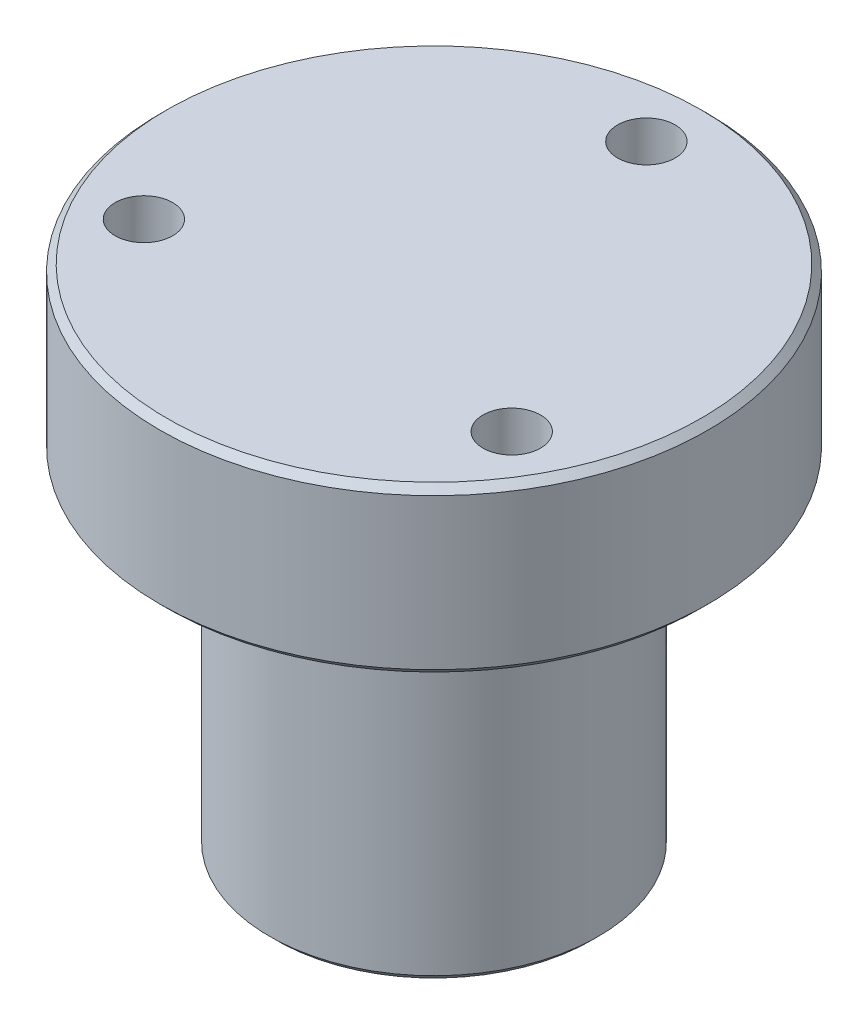
ISO-10303-21;
HEADER;
FILE_DESCRIPTION(('STEP AP214'),'2;1');
FILE_NAME('part.step','',(''),(''),'','','');
FILE_SCHEMA(('AUTOMOTIVE_DESIGN { 1 0 10303 214 1 1 1 1 }'));
ENDSEC;
DATA;
#1=APPLICATION_CONTEXT('core data for automotive mechanical design processes');
#2=APPLICATION_PROTOCOL_DEFINITION('international standard','automotive_design',2000,#1);
#3=PRODUCT_CONTEXT('',#1,'mechanical');
#4=PRODUCT('Part','Part','',(#3));
#5=PRODUCT_RELATED_PRODUCT_CATEGORY('part','',(#4));
#6=PRODUCT_DEFINITION_FORMATION('','',#4);
#7=PRODUCT_DEFINITION_CONTEXT('part definition',#1,'design');
#8=PRODUCT_DEFINITION('design','',#6,#7);
#9=PRODUCT_DEFINITION_SHAPE('','',#8);
#10=(LENGTH_UNIT() NAMED_UNIT(*) SI_UNIT(.MILLI.,.METRE.));
#11=(NAMED_UNIT(*) PLANE_ANGLE_UNIT() SI_UNIT($,.RADIAN.));
#12=(NAMED_UNIT(*) SI_UNIT($,.STERADIAN.) SOLID_ANGLE_UNIT());
#13=UNCERTAINTY_MEASURE_WITH_UNIT(LENGTH_MEASURE(1.E-05),#10,'distance_accuracy_value','');
#14=(GEOMETRIC_REPRESENTATION_CONTEXT(3) GLOBAL_UNCERTAINTY_ASSIGNED_CONTEXT((#13)) GLOBAL_UNIT_ASSIGNED_CONTEXT((#10,
#11,#12)) REPRESENTATION_CONTEXT('',''));
#15=CARTESIAN_POINT('',(0.,0.,0.));
#16=DIRECTION('',(0.,0.,1.));
#17=DIRECTION('',(1.,0.,0.));
#18=AXIS2_PLACEMENT_3D('',#15,#16,#17);
#19=CARTESIAN_POINT('',(11.5,0.,0.));
#20=DIRECTION('',(0.,-1.,0.));
#21=DIRECTION('',(0.,0.,-1.));
#22=AXIS2_PLACEMENT_3D('',#19,#20,#21);
#23=PLANE('',#22);
#24=CARTESIAN_POINT('',(0.,0.,0.));
#25=DIRECTION('',(0.,-1.,0.));
#26=DIRECTION('',(0.,0.,-1.));
#27=AXIS2_PLACEMENT_3D('',#24,#25,#26);
#28=CIRCLE('',#27,11.5);
#29=CARTESIAN_POINT('',(0.,0.,-11.5));
#30=VERTEX_POINT('',#29);
#31=EDGE_CURVE('E72',#30,#30,#28,.T.);
#32=ORIENTED_EDGE('',*,*,#31,.T.);
#33=EDGE_LOOP('',(#32));
#34=FACE_BOUND('',#33,.T.);
#35=ADVANCED_FACE('F43',(#34),#23,.T.);
#36=CARTESIAN_POINT('',(0.,37.,0.));
#37=DIRECTION('',(0.,1.,0.));
#38=DIRECTION('',(0.,0.,1.));
#39=AXIS2_PLACEMENT_3D('',#36,#37,#38);
#40=PLANE('',#39);
#41=CARTESIAN_POINT('',(0.,37.,-15.5));
#42=DIRECTION('',(0.,1.,0.));
#43=DIRECTION('',(0.,0.,1.));
#44=AXIS2_PLACEMENT_3D('',#41,#42,#43);
#45=CIRCLE('',#44,2.10058);
#46=CARTESIAN_POINT('',(0.,37.,-13.39942));
#47=VERTEX_POINT('',#46);
#48=EDGE_CURVE('E65',#47,#47,#45,.T.);
#49=ORIENTED_EDGE('',*,*,#48,.F.);
#50=EDGE_LOOP('',(#49));
#51=FACE_BOUND('',#50,.T.);
#52=CARTESIAN_POINT('',(13.4233937586595,37.,7.74999999999962));
#53=DIRECTION('',(0.,1.,0.));
#54=DIRECTION('',(0.,0.,1.));
#55=AXIS2_PLACEMENT_3D('',#52,#53,#54);
#56=CIRCLE('',#55,2.10058000000059);
#57=CARTESIAN_POINT('',(13.4233937586595,37.,9.85058000000021));
#58=VERTEX_POINT('',#57);
#59=EDGE_CURVE('E130',#58,#58,#56,.T.);
#60=ORIENTED_EDGE('',*,*,#59,.F.);
#61=EDGE_LOOP('',(#60));
#62=FACE_BOUND('',#61,.T.);
#63=CARTESIAN_POINT('',(-13.4233937586581,37.,7.75000000000038));
#64=DIRECTION('',(0.,1.,0.));
#65=DIRECTION('',(0.,0.,1.));
#66=AXIS2_PLACEMENT_3D('',#63,#64,#65);
#67=CIRCLE('',#66,2.10058000000087);
#68=CARTESIAN_POINT('',(-13.4233937586581,37.,9.85058000000125));
#69=VERTEX_POINT('',#68);
#70=EDGE_CURVE('E86',#69,#69,#67,.T.);
#71=ORIENTED_EDGE('',*,*,#70,.F.);
#72=EDGE_LOOP('',(#71));
#73=FACE_BOUND('',#72,.T.);
#74=CARTESIAN_POINT('',(0.,37.,0.));
#75=DIRECTION('',(0.,-1.,0.));
#76=DIRECTION('',(0.,0.,-1.));
#77=AXIS2_PLACEMENT_3D('',#74,#75,#76);
#78=CIRCLE('',#77,19.5);
#79=CARTESIAN_POINT('',(0.,37.,-19.5));
#80=VERTEX_POINT('',#79);
#81=EDGE_CURVE('E10',#80,#80,#78,.T.);
#82=ORIENTED_EDGE('',*,*,#81,.F.);
#83=EDGE_LOOP('',(#82));
#84=FACE_BOUND('',#83,.T.);
#85=ADVANCED_FACE('F113',(#51,#62,#73,#84),#40,.T.);
#86=CARTESIAN_POINT('',(0.,36.5,0.));
#87=DIRECTION('',(0.,-1.,0.));
#88=DIRECTION('',(0.,0.,-1.));
#89=AXIS2_PLACEMENT_3D('',#86,#87,#88);
#90=CONICAL_SURFACE('',#89,20.,0.785398163397448);
#91=ORIENTED_EDGE('',*,*,#81,.T.);
#92=EDGE_LOOP('',(#91));
#93=FACE_BOUND('',#92,.T.);
#94=CARTESIAN_POINT('',(0.,36.5,0.));
#95=DIRECTION('',(0.,-1.,0.));
#96=DIRECTION('',(0.,0.,-1.));
#97=AXIS2_PLACEMENT_3D('',#94,#95,#96);
#98=CIRCLE('',#97,20.);
#99=CARTESIAN_POINT('',(0.,36.5,-20.));
#100=VERTEX_POINT('',#99);
#101=EDGE_CURVE('E51',#100,#100,#98,.T.);
#102=ORIENTED_EDGE('',*,*,#101,.F.);
#103=EDGE_LOOP('',(#102));
#104=FACE_BOUND('',#103,.T.);
#105=ADVANCED_FACE('F104',(#93,#104),#90,.T.);
#106=CARTESIAN_POINT('',(0.,0.,0.));
#107=DIRECTION('',(0.,-1.,0.));
#108=DIRECTION('',(0.,0.,-1.));
#109=AXIS2_PLACEMENT_3D('',#106,#107,#108);
#110=CYLINDRICAL_SURFACE('',#109,20.);
#111=ORIENTED_EDGE('',*,*,#101,.T.);
#112=EDGE_LOOP('',(#111));
#113=FACE_BOUND('',#112,.T.);
#114=CARTESIAN_POINT('',(0.,25.5,0.));
#115=DIRECTION('',(0.,-1.,0.));
#116=DIRECTION('',(0.,0.,-1.));
#117=AXIS2_PLACEMENT_3D('',#114,#115,#116);
#118=CIRCLE('',#117,20.);
#119=CARTESIAN_POINT('',(0.,25.5,-20.));
#120=VERTEX_POINT('',#119);
#121=EDGE_CURVE('E57',#120,#120,#118,.T.);
#122=ORIENTED_EDGE('',*,*,#121,.F.);
#123=EDGE_LOOP('',(#122));
#124=FACE_BOUND('',#123,.T.);
#125=ADVANCED_FACE('F102',(#113,#124),#110,.T.);
#126=CARTESIAN_POINT('',(0.,25.,0.));
#127=DIRECTION('',(0.,1.,0.));
#128=DIRECTION('',(0.,0.,1.));
#129=AXIS2_PLACEMENT_3D('',#126,#127,#128);
#130=CONICAL_SURFACE('',#129,19.5,0.785398163397448);
#131=ORIENTED_EDGE('',*,*,#121,.T.);
#132=EDGE_LOOP('',(#131));
#133=FACE_BOUND('',#132,.T.);
#134=CARTESIAN_POINT('',(0.,25.,0.));
#135=DIRECTION('',(0.,-1.,0.));
#136=DIRECTION('',(0.,0.,-1.));
#137=AXIS2_PLACEMENT_3D('',#134,#135,#136);
#138=CIRCLE('',#137,19.5);
#139=CARTESIAN_POINT('',(0.,25.,-19.5));
#140=VERTEX_POINT('',#139);
#141=EDGE_CURVE('E92',#140,#140,#138,.T.);
#142=ORIENTED_EDGE('',*,*,#141,.F.);
#143=EDGE_LOOP('',(#142));
#144=FACE_BOUND('',#143,.T.);
#145=ADVANCED_FACE('F99',(#133,#144),#130,.T.);
#146=CARTESIAN_POINT('',(19.5,25.,0.));
#147=DIRECTION('',(0.,-1.,0.));
#148=DIRECTION('',(0.,0.,-1.));
#149=AXIS2_PLACEMENT_3D('',#146,#147,#148);
#150=PLANE('',#149);
#151=CARTESIAN_POINT('',(0.,25.,-15.5));
#152=DIRECTION('',(0.,-1.,0.));
#153=DIRECTION('',(0.,0.,-1.));
#154=AXIS2_PLACEMENT_3D('',#151,#152,#153);
#155=CIRCLE('',#154,2.10058);
#156=CARTESIAN_POINT('',(0.,25.,-17.60058));
#157=VERTEX_POINT('',#156);
#158=EDGE_CURVE('E46',#157,#157,#155,.T.);
#159=ORIENTED_EDGE('',*,*,#158,.F.);
#160=EDGE_LOOP('',(#159));
#161=FACE_BOUND('',#160,.T.);
#162=CARTESIAN_POINT('',(13.4233937586595,25.,7.74999999999962));
#163=DIRECTION('',(0.,-1.,0.));
#164=DIRECTION('',(0.,0.,-1.));
#165=AXIS2_PLACEMENT_3D('',#162,#163,#164);
#166=CIRCLE('',#165,2.10058000000059);
#167=CARTESIAN_POINT('',(13.4233937586595,25.,5.64941999999903));
#168=VERTEX_POINT('',#167);
#169=EDGE_CURVE('E64',#168,#168,#166,.T.);
#170=ORIENTED_EDGE('',*,*,#169,.F.);
#171=EDGE_LOOP('',(#170));
#172=FACE_BOUND('',#171,.T.);
#173=CARTESIAN_POINT('',(-13.4233937586581,25.,7.75000000000038));
#174=DIRECTION('',(0.,-1.,0.));
#175=DIRECTION('',(0.,0.,-1.));
#176=AXIS2_PLACEMENT_3D('',#173,#174,#175);
#177=CIRCLE('',#176,2.10058000000087);
#178=CARTESIAN_POINT('',(-13.4233937586581,25.,5.64941999999951));
#179=VERTEX_POINT('',#178);
#180=EDGE_CURVE('E61',#179,#179,#177,.T.);
#181=ORIENTED_EDGE('',*,*,#180,.F.);
#182=EDGE_LOOP('',(#181));
#183=FACE_BOUND('',#182,.T.);
#184=ORIENTED_EDGE('',*,*,#141,.T.);
#185=EDGE_LOOP('',(#184));
#186=FACE_BOUND('',#185,.T.);
#187=CARTESIAN_POINT('',(0.,25.,0.));
#188=DIRECTION('',(0.,-1.,0.));
#189=DIRECTION('',(0.,0.,-1.));
#190=AXIS2_PLACEMENT_3D('',#187,#188,#189);
#191=CIRCLE('',#190,12.);
#192=CARTESIAN_POINT('',(0.,25.,-12.));
#193=VERTEX_POINT('',#192);
#194=EDGE_CURVE('E83',#193,#193,#191,.T.);
#195=ORIENTED_EDGE('',*,*,#194,.F.);
#196=EDGE_LOOP('',(#195));
#197=FACE_BOUND('',#196,.T.);
#198=ADVANCED_FACE('F111',(#161,#172,#183,#186,#197),#150,.T.);
#199=CARTESIAN_POINT('',(0.,0.,0.));
#200=DIRECTION('',(0.,-1.,0.));
#201=DIRECTION('',(0.,0.,-1.));
#202=AXIS2_PLACEMENT_3D('',#199,#200,#201);
#203=CYLINDRICAL_SURFACE('',#202,12.);
#204=ORIENTED_EDGE('',*,*,#194,.T.);
#205=EDGE_LOOP('',(#204));
#206=FACE_BOUND('',#205,.T.);
#207=CARTESIAN_POINT('',(0.,0.5,0.));
#208=DIRECTION('',(0.,-1.,0.));
#209=DIRECTION('',(0.,0.,-1.));
#210=AXIS2_PLACEMENT_3D('',#207,#208,#209);
#211=CIRCLE('',#210,12.);
#212=CARTESIAN_POINT('',(0.,0.5,-12.));
#213=VERTEX_POINT('',#212);
#214=EDGE_CURVE('E77',#213,#213,#211,.T.);
#215=ORIENTED_EDGE('',*,*,#214,.F.);
#216=EDGE_LOOP('',(#215));
#217=FACE_BOUND('',#216,.T.);
#218=ADVANCED_FACE('F156',(#206,#217),#203,.T.);
#219=CARTESIAN_POINT('',(0.,0.,0.));
#220=DIRECTION('',(0.,1.,0.));
#221=DIRECTION('',(0.,0.,1.));
#222=AXIS2_PLACEMENT_3D('',#219,#220,#221);
#223=CONICAL_SURFACE('',#222,11.5,0.785398163397449);
#224=ORIENTED_EDGE('',*,*,#214,.T.);
#225=EDGE_LOOP('',(#224));
#226=FACE_BOUND('',#225,.T.);
#227=ORIENTED_EDGE('',*,*,#31,.F.);
#228=EDGE_LOOP('',(#227));
#229=FACE_BOUND('',#228,.T.);
#230=ADVANCED_FACE('F153',(#226,#229),#223,.T.);
#231=CARTESIAN_POINT('',(-13.4233937586581,0.,7.75000000000038));
#232=DIRECTION('',(0.,1.,0.));
#233=DIRECTION('',(0.,0.,1.));
#234=AXIS2_PLACEMENT_3D('',#231,#232,#233);
#235=CYLINDRICAL_SURFACE('',#234,2.10058000000087);
#236=ORIENTED_EDGE('',*,*,#180,.T.);
#237=EDGE_LOOP('',(#236));
#238=FACE_BOUND('',#237,.T.);
#239=ORIENTED_EDGE('',*,*,#70,.T.);
#240=EDGE_LOOP('',(#239));
#241=FACE_BOUND('',#240,.T.);
#242=ADVANCED_FACE('F148',(#238,#241),#235,.F.);
#243=CARTESIAN_POINT('',(13.4233937586595,0.,7.74999999999962));
#244=DIRECTION('',(0.,1.,0.));
#245=DIRECTION('',(0.,0.,1.));
#246=AXIS2_PLACEMENT_3D('',#243,#244,#245);
#247=CYLINDRICAL_SURFACE('',#246,2.10058000000059);
#248=ORIENTED_EDGE('',*,*,#169,.T.);
#249=EDGE_LOOP('',(#248));
#250=FACE_BOUND('',#249,.T.);
#251=ORIENTED_EDGE('',*,*,#59,.T.);
#252=EDGE_LOOP('',(#251));
#253=FACE_BOUND('',#252,.T.);
#254=ADVANCED_FACE('F143',(#250,#253),#247,.F.);
#255=CARTESIAN_POINT('',(0.,0.,-15.5));
#256=DIRECTION('',(0.,1.,0.));
#257=DIRECTION('',(0.,0.,1.));
#258=AXIS2_PLACEMENT_3D('',#255,#256,#257);
#259=CYLINDRICAL_SURFACE('',#258,2.10058);
#260=ORIENTED_EDGE('',*,*,#158,.T.);
#261=EDGE_LOOP('',(#260));
#262=FACE_BOUND('',#261,.T.);
#263=ORIENTED_EDGE('',*,*,#48,.T.);
#264=EDGE_LOOP('',(#263));
#265=FACE_BOUND('',#264,.T.);
#266=ADVANCED_FACE('F141',(#262,#265),#259,.F.);
#267=CLOSED_SHELL('',(#35,#85,#105,#125,#145,#198,#218,#230,#242,#254,#266));
#268=MANIFOLD_SOLID_BREP('B2',#267);
#269=ADVANCED_BREP_SHAPE_REPRESENTATION('',(#18,#268),#14);
#270=SHAPE_DEFINITION_REPRESENTATION(#9,#269);
ENDSEC;
END-ISO-10303-21;
